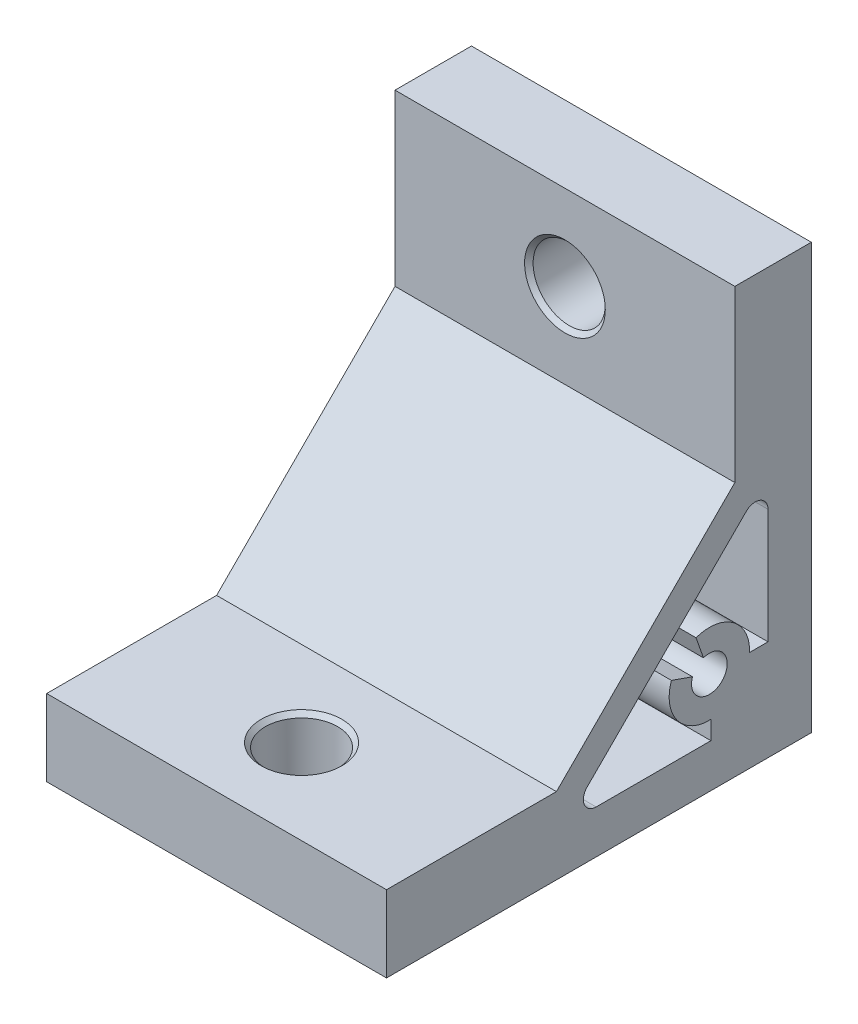
ISO-10303-21;
HEADER;
FILE_DESCRIPTION(('STEP AP214'),'2;1');
FILE_NAME('part.step','',(''),(''),'','','');
FILE_SCHEMA(('AUTOMOTIVE_DESIGN { 1 0 10303 214 1 1 1 1 }'));
ENDSEC;
DATA;
#1=APPLICATION_CONTEXT('core data for automotive mechanical design processes');
#2=APPLICATION_PROTOCOL_DEFINITION('international standard','automotive_design',2000,#1);
#3=PRODUCT_CONTEXT('',#1,'mechanical');
#4=PRODUCT('Part','Part','',(#3));
#5=PRODUCT_RELATED_PRODUCT_CATEGORY('part','',(#4));
#6=PRODUCT_DEFINITION_FORMATION('','',#4);
#7=PRODUCT_DEFINITION_CONTEXT('part definition',#1,'design');
#8=PRODUCT_DEFINITION('design','',#6,#7);
#9=PRODUCT_DEFINITION_SHAPE('','',#8);
#10=(LENGTH_UNIT() NAMED_UNIT(*) SI_UNIT(.MILLI.,.METRE.));
#11=(NAMED_UNIT(*) PLANE_ANGLE_UNIT() SI_UNIT($,.RADIAN.));
#12=(NAMED_UNIT(*) SI_UNIT($,.STERADIAN.) SOLID_ANGLE_UNIT());
#13=UNCERTAINTY_MEASURE_WITH_UNIT(LENGTH_MEASURE(1.E-05),#10,'distance_accuracy_value','');
#14=(GEOMETRIC_REPRESENTATION_CONTEXT(3) GLOBAL_UNCERTAINTY_ASSIGNED_CONTEXT((#13)) GLOBAL_UNIT_ASSIGNED_CONTEXT((#10,
#11,#12)) REPRESENTATION_CONTEXT('',''));
#15=CARTESIAN_POINT('',(0.,0.,0.));
#16=DIRECTION('',(0.,0.,1.));
#17=DIRECTION('',(1.,0.,0.));
#18=AXIS2_PLACEMENT_3D('',#15,#16,#17);
#19=CARTESIAN_POINT('',(20.,9.,25.));
#20=DIRECTION('',(0.,0.,-1.));
#21=DIRECTION('',(0.,1.,0.));
#22=AXIS2_PLACEMENT_3D('',#19,#20,#21);
#23=PLANE('',#22);
#24=DIRECTION('',(0.,-1.,0.));
#25=VECTOR('',#24,1.);
#26=CARTESIAN_POINT('',(-20.,9.,25.));
#27=LINE('',#26,#25);
#28=CARTESIAN_POINT('',(-20.,9.,25.));
#29=VERTEX_POINT('',#28);
#30=CARTESIAN_POINT('',(-20.,0.,25.));
#31=VERTEX_POINT('',#30);
#32=EDGE_CURVE('E247',#29,#31,#27,.T.);
#33=ORIENTED_EDGE('',*,*,#32,.T.);
#34=DIRECTION('',(-1.,0.,0.));
#35=VECTOR('',#34,1.);
#36=CARTESIAN_POINT('',(20.,0.,25.));
#37=LINE('',#36,#35);
#38=CARTESIAN_POINT('',(20.,0.,25.));
#39=VERTEX_POINT('',#38);
#40=EDGE_CURVE('E309',#39,#31,#37,.T.);
#41=ORIENTED_EDGE('',*,*,#40,.F.);
#42=DIRECTION('',(0.,-1.,0.));
#43=VECTOR('',#42,1.);
#44=CARTESIAN_POINT('',(20.,9.,25.));
#45=LINE('',#44,#43);
#46=CARTESIAN_POINT('',(20.,9.,25.));
#47=VERTEX_POINT('',#46);
#48=EDGE_CURVE('E262',#47,#39,#45,.T.);
#49=ORIENTED_EDGE('',*,*,#48,.F.);
#50=DIRECTION('',(-1.,0.,0.));
#51=VECTOR('',#50,1.);
#52=CARTESIAN_POINT('',(20.,9.,25.));
#53=LINE('',#52,#51);
#54=EDGE_CURVE('E278',#47,#29,#53,.T.);
#55=ORIENTED_EDGE('',*,*,#54,.T.);
#56=EDGE_LOOP('',(#33,#41,#49,#55));
#57=FACE_BOUND('',#56,.T.);
#58=ADVANCED_FACE('F16',(#57),#23,.F.);
#59=CARTESIAN_POINT('',(20.,0.,25.));
#60=DIRECTION('',(0.,1.,0.));
#61=DIRECTION('',(0.,0.,1.));
#62=AXIS2_PLACEMENT_3D('',#59,#60,#61);
#63=PLANE('',#62);
#64=CARTESIAN_POINT('',(0.,0.,15.));
#65=DIRECTION('',(0.,1.,0.));
#66=DIRECTION('',(0.,0.,1.));
#67=AXIS2_PLACEMENT_3D('',#64,#65,#66);
#68=CIRCLE('',#67,4.75);
#69=CARTESIAN_POINT('',(0.,0.,19.75));
#70=VERTEX_POINT('',#69);
#71=EDGE_CURVE('E327',#70,#70,#68,.T.);
#72=ORIENTED_EDGE('',*,*,#71,.T.);
#73=EDGE_LOOP('',(#72));
#74=FACE_BOUND('',#73,.T.);
#75=DIRECTION('',(0.,0.,-1.));
#76=VECTOR('',#75,1.);
#77=CARTESIAN_POINT('',(-20.,0.,25.));
#78=LINE('',#77,#76);
#79=CARTESIAN_POINT('',(-20.,0.,-25.));
#80=VERTEX_POINT('',#79);
#81=EDGE_CURVE('E281',#31,#80,#78,.T.);
#82=ORIENTED_EDGE('',*,*,#81,.T.);
#83=DIRECTION('',(-1.,0.,0.));
#84=VECTOR('',#83,1.);
#85=CARTESIAN_POINT('',(20.,0.,-25.));
#86=LINE('',#85,#84);
#87=CARTESIAN_POINT('',(20.,0.,-25.));
#88=VERTEX_POINT('',#87);
#89=EDGE_CURVE('E306',#88,#80,#86,.T.);
#90=ORIENTED_EDGE('',*,*,#89,.F.);
#91=DIRECTION('',(0.,0.,-1.));
#92=VECTOR('',#91,1.);
#93=CARTESIAN_POINT('',(20.,0.,25.));
#94=LINE('',#93,#92);
#95=EDGE_CURVE('E265',#39,#88,#94,.T.);
#96=ORIENTED_EDGE('',*,*,#95,.F.);
#97=ORIENTED_EDGE('',*,*,#40,.T.);
#98=EDGE_LOOP('',(#82,#90,#96,#97));
#99=FACE_BOUND('',#98,.T.);
#100=ADVANCED_FACE('F373',(#74,#99),#63,.F.);
#101=CARTESIAN_POINT('',(20.,0.,-25.));
#102=DIRECTION('',(0.,0.,1.));
#103=DIRECTION('',(0.,-1.,0.));
#104=AXIS2_PLACEMENT_3D('',#101,#102,#103);
#105=PLANE('',#104);
#106=CARTESIAN_POINT('',(0.,40.,-25.));
#107=DIRECTION('',(0.,0.,1.));
#108=DIRECTION('',(0.,-1.,0.));
#109=AXIS2_PLACEMENT_3D('',#106,#107,#108);
#110=CIRCLE('',#109,4.74999999999999);
#111=CARTESIAN_POINT('',(0.,35.25,-25.));
#112=VERTEX_POINT('',#111);
#113=EDGE_CURVE('E336',#112,#112,#110,.T.);
#114=ORIENTED_EDGE('',*,*,#113,.T.);
#115=EDGE_LOOP('',(#114));
#116=FACE_BOUND('',#115,.T.);
#117=DIRECTION('',(0.,1.,0.));
#118=VECTOR('',#117,1.);
#119=CARTESIAN_POINT('',(-20.,0.,-25.));
#120=LINE('',#119,#118);
#121=CARTESIAN_POINT('',(-20.,50.,-25.));
#122=VERTEX_POINT('',#121);
#123=EDGE_CURVE('E283',#80,#122,#120,.T.);
#124=ORIENTED_EDGE('',*,*,#123,.T.);
#125=DIRECTION('',(-1.,0.,0.));
#126=VECTOR('',#125,1.);
#127=CARTESIAN_POINT('',(20.,50.,-25.));
#128=LINE('',#127,#126);
#129=CARTESIAN_POINT('',(20.,50.,-25.));
#130=VERTEX_POINT('',#129);
#131=EDGE_CURVE('E303',#130,#122,#128,.T.);
#132=ORIENTED_EDGE('',*,*,#131,.F.);
#133=DIRECTION('',(0.,1.,0.));
#134=VECTOR('',#133,1.);
#135=CARTESIAN_POINT('',(20.,0.,-25.));
#136=LINE('',#135,#134);
#137=EDGE_CURVE('E268',#88,#130,#136,.T.);
#138=ORIENTED_EDGE('',*,*,#137,.F.);
#139=ORIENTED_EDGE('',*,*,#89,.T.);
#140=EDGE_LOOP('',(#124,#132,#138,#139));
#141=FACE_BOUND('',#140,.T.);
#142=ADVANCED_FACE('F379',(#116,#141),#105,.F.);
#143=CARTESIAN_POINT('',(20.,50.,-25.));
#144=DIRECTION('',(0.,-1.,0.));
#145=DIRECTION('',(0.,0.,-1.));
#146=AXIS2_PLACEMENT_3D('',#143,#144,#145);
#147=PLANE('',#146);
#148=DIRECTION('',(0.,0.,1.));
#149=VECTOR('',#148,1.);
#150=CARTESIAN_POINT('',(-20.,50.,-25.));
#151=LINE('',#150,#149);
#152=CARTESIAN_POINT('',(-20.,50.,-16.));
#153=VERTEX_POINT('',#152);
#154=EDGE_CURVE('E285',#122,#153,#151,.T.);
#155=ORIENTED_EDGE('',*,*,#154,.T.);
#156=DIRECTION('',(-1.,0.,0.));
#157=VECTOR('',#156,1.);
#158=CARTESIAN_POINT('',(20.,50.,-16.));
#159=LINE('',#158,#157);
#160=CARTESIAN_POINT('',(20.,50.,-16.));
#161=VERTEX_POINT('',#160);
#162=EDGE_CURVE('E300',#161,#153,#159,.T.);
#163=ORIENTED_EDGE('',*,*,#162,.F.);
#164=DIRECTION('',(0.,0.,1.));
#165=VECTOR('',#164,1.);
#166=CARTESIAN_POINT('',(20.,50.,-25.));
#167=LINE('',#166,#165);
#168=EDGE_CURVE('E270',#130,#161,#167,.T.);
#169=ORIENTED_EDGE('',*,*,#168,.F.);
#170=ORIENTED_EDGE('',*,*,#131,.T.);
#171=EDGE_LOOP('',(#155,#163,#169,#170));
#172=FACE_BOUND('',#171,.T.);
#173=ADVANCED_FACE('F401',(#172),#147,.F.);
#174=CARTESIAN_POINT('',(20.,50.,-16.));
#175=DIRECTION('',(0.,0.,-1.));
#176=DIRECTION('',(0.,1.,0.));
#177=AXIS2_PLACEMENT_3D('',#174,#175,#176);
#178=PLANE('',#177);
#179=CARTESIAN_POINT('',(0.,40.,-16.));
#180=DIRECTION('',(0.,0.,-1.));
#181=DIRECTION('',(0.,1.,0.));
#182=AXIS2_PLACEMENT_3D('',#179,#180,#181);
#183=CIRCLE('',#182,4.75000000000003);
#184=CARTESIAN_POINT('',(0.,44.75,-16.));
#185=VERTEX_POINT('',#184);
#186=EDGE_CURVE('E10',#185,#185,#183,.T.);
#187=ORIENTED_EDGE('',*,*,#186,.T.);
#188=EDGE_LOOP('',(#187));
#189=FACE_BOUND('',#188,.T.);
#190=DIRECTION('',(0.,-1.,0.));
#191=VECTOR('',#190,1.);
#192=CARTESIAN_POINT('',(-20.,50.,-16.));
#193=LINE('',#192,#191);
#194=CARTESIAN_POINT('',(-20.,30.,-16.));
#195=VERTEX_POINT('',#194);
#196=EDGE_CURVE('E287',#153,#195,#193,.T.);
#197=ORIENTED_EDGE('',*,*,#196,.T.);
#198=DIRECTION('',(-1.,0.,0.));
#199=VECTOR('',#198,1.);
#200=CARTESIAN_POINT('',(20.,30.,-16.));
#201=LINE('',#200,#199);
#202=CARTESIAN_POINT('',(20.,30.,-16.));
#203=VERTEX_POINT('',#202);
#204=EDGE_CURVE('E297',#203,#195,#201,.T.);
#205=ORIENTED_EDGE('',*,*,#204,.F.);
#206=DIRECTION('',(0.,-1.,0.));
#207=VECTOR('',#206,1.);
#208=CARTESIAN_POINT('',(20.,50.,-16.));
#209=LINE('',#208,#207);
#210=EDGE_CURVE('E272',#161,#203,#209,.T.);
#211=ORIENTED_EDGE('',*,*,#210,.F.);
#212=ORIENTED_EDGE('',*,*,#162,.T.);
#213=EDGE_LOOP('',(#197,#205,#211,#212));
#214=FACE_BOUND('',#213,.T.);
#215=ADVANCED_FACE('F416',(#189,#214),#178,.F.);
#216=CARTESIAN_POINT('',(20.,30.,-16.));
#217=DIRECTION('',(0.,-0.707106781186547,-0.707106781186548));
#218=DIRECTION('',(0.,0.707106781186548,-0.707106781186547));
#219=AXIS2_PLACEMENT_3D('',#216,#217,#218);
#220=PLANE('',#219);
#221=DIRECTION('',(0.,-0.707106781186548,0.707106781186547));
#222=VECTOR('',#221,1.);
#223=CARTESIAN_POINT('',(-20.,30.,-16.));
#224=LINE('',#223,#222);
#225=CARTESIAN_POINT('',(-20.,9.,5.));
#226=VERTEX_POINT('',#225);
#227=EDGE_CURVE('E289',#195,#226,#224,.T.);
#228=ORIENTED_EDGE('',*,*,#227,.T.);
#229=DIRECTION('',(-1.,0.,0.));
#230=VECTOR('',#229,1.);
#231=CARTESIAN_POINT('',(20.,9.,5.));
#232=LINE('',#231,#230);
#233=CARTESIAN_POINT('',(20.,9.,5.));
#234=VERTEX_POINT('',#233);
#235=EDGE_CURVE('E294',#234,#226,#232,.T.);
#236=ORIENTED_EDGE('',*,*,#235,.F.);
#237=DIRECTION('',(0.,-0.707106781186548,0.707106781186547));
#238=VECTOR('',#237,1.);
#239=CARTESIAN_POINT('',(20.,30.,-16.));
#240=LINE('',#239,#238);
#241=EDGE_CURVE('E274',#203,#234,#240,.T.);
#242=ORIENTED_EDGE('',*,*,#241,.F.);
#243=ORIENTED_EDGE('',*,*,#204,.T.);
#244=EDGE_LOOP('',(#228,#236,#242,#243));
#245=FACE_BOUND('',#244,.T.);
#246=ADVANCED_FACE('F420',(#245),#220,.F.);
#247=CARTESIAN_POINT('',(20.,9.,5.));
#248=DIRECTION('',(0.,-1.,0.));
#249=DIRECTION('',(0.,0.,-1.));
#250=AXIS2_PLACEMENT_3D('',#247,#248,#249);
#251=PLANE('',#250);
#252=CARTESIAN_POINT('',(0.,9.,15.));
#253=DIRECTION('',(0.,-1.,0.));
#254=DIRECTION('',(0.,0.,-1.));
#255=AXIS2_PLACEMENT_3D('',#252,#253,#254);
#256=CIRCLE('',#255,4.75000000000001);
#257=CARTESIAN_POINT('',(0.,9.,10.25));
#258=VERTEX_POINT('',#257);
#259=EDGE_CURVE('E24',#258,#258,#256,.T.);
#260=ORIENTED_EDGE('',*,*,#259,.T.);
#261=EDGE_LOOP('',(#260));
#262=FACE_BOUND('',#261,.T.);
#263=DIRECTION('',(0.,0.,1.));
#264=VECTOR('',#263,1.);
#265=CARTESIAN_POINT('',(-20.,9.,5.));
#266=LINE('',#265,#264);
#267=EDGE_CURVE('E266',#226,#29,#266,.T.);
#268=ORIENTED_EDGE('',*,*,#267,.T.);
#269=ORIENTED_EDGE('',*,*,#54,.F.);
#270=DIRECTION('',(0.,0.,1.));
#271=VECTOR('',#270,1.);
#272=CARTESIAN_POINT('',(20.,9.,5.));
#273=LINE('',#272,#271);
#274=EDGE_CURVE('E276',#234,#47,#273,.T.);
#275=ORIENTED_EDGE('',*,*,#274,.F.);
#276=ORIENTED_EDGE('',*,*,#235,.T.);
#277=EDGE_LOOP('',(#268,#269,#275,#276));
#278=FACE_BOUND('',#277,.T.);
#279=ADVANCED_FACE('F347',(#262,#278),#251,.F.);
#280=CARTESIAN_POINT('',(20.,0.,0.));
#281=DIRECTION('',(1.,0.,0.));
#282=DIRECTION('',(0.,0.,-1.));
#283=AXIS2_PLACEMENT_3D('',#280,#281,#282);
#284=PLANE('',#283);
#285=DIRECTION('',(0.,-0.707106781186548,0.707106781186547));
#286=VECTOR('',#285,1.);
#287=CARTESIAN_POINT('',(20.,28.9502525316942,-19.9));
#288=LINE('',#287,#286);
#289=CARTESIAN_POINT('',(20.,26.3895923599143,-17.3393398282202));
#290=VERTEX_POINT('',#289);
#291=CARTESIAN_POINT('',(20.,7.66066017177982,1.38959235991435));
#292=VERTEX_POINT('',#291);
#293=EDGE_CURVE('E213',#290,#292,#288,.T.);
#294=ORIENTED_EDGE('',*,*,#293,.F.);
#295=CARTESIAN_POINT('',(20.,25.3289321881345,-18.4));
#296=DIRECTION('',(1.,0.,0.));
#297=DIRECTION('',(0.,0.,-1.));
#298=AXIS2_PLACEMENT_3D('',#295,#296,#297);
#299=CIRCLE('',#298,1.5);
#300=CARTESIAN_POINT('',(20.,25.3289321881345,-19.9));
#301=VERTEX_POINT('',#300);
#302=EDGE_CURVE('E321',#290,#301,#299,.F.);
#303=ORIENTED_EDGE('',*,*,#302,.T.);
#304=DIRECTION('',(0.,1.,0.));
#305=VECTOR('',#304,1.);
#306=CARTESIAN_POINT('',(20.,11.8175144212722,-19.9));
#307=LINE('',#306,#305);
#308=CARTESIAN_POINT('',(20.,11.8175144212722,-19.9));
#309=VERTEX_POINT('',#308);
#310=EDGE_CURVE('E242',#309,#301,#307,.T.);
#311=ORIENTED_EDGE('',*,*,#310,.F.);
#312=DIRECTION('',(0.,0.,-1.));
#313=VECTOR('',#312,1.);
#314=CARTESIAN_POINT('',(20.,11.8175144212722,-19.9));
#315=LINE('',#314,#313);
#316=CARTESIAN_POINT('',(20.,11.8175144212722,-17.7212143947472));
#317=VERTEX_POINT('',#316);
#318=EDGE_CURVE('E239',#317,#309,#315,.T.);
#319=ORIENTED_EDGE('',*,*,#318,.F.);
#320=CARTESIAN_POINT('',(20.,11.9915806749646,-18.8106071973736));
#321=DIRECTION('',(1.,0.,0.));
#322=DIRECTION('',(0.,0.,-1.));
#323=AXIS2_PLACEMENT_3D('',#320,#321,#322);
#324=CIRCLE('',#323,1.10321155681434);
#325=CARTESIAN_POINT('',(20.,12.2187165848335,-17.7310308834723));
#326=VERTEX_POINT('',#325);
#327=EDGE_CURVE('E236',#326,#317,#324,.T.);
#328=ORIENTED_EDGE('',*,*,#327,.F.);
#329=CARTESIAN_POINT('',(20.,12.,-13.));
#330=DIRECTION('',(-1.,0.,0.));
#331=DIRECTION('',(0.,0.,-1.));
#332=AXIS2_PLACEMENT_3D('',#329,#330,#331);
#333=CIRCLE('',#332,4.73608384267528);
#334=CARTESIAN_POINT('',(20.,16.4685082983771,-11.4306295044877));
#335=VERTEX_POINT('',#334);
#336=EDGE_CURVE('E233',#335,#326,#333,.T.);
#337=ORIENTED_EDGE('',*,*,#336,.F.);
#338=DIRECTION('',(0.,0.943502785595325,0.331364593120421));
#339=VECTOR('',#338,1.);
#340=CARTESIAN_POINT('',(20.,16.4685082983771,-11.4306295044877));
#341=LINE('',#340,#339);
#342=CARTESIAN_POINT('',(20.,13.9813558497502,-12.3041343544471));
#343=VERTEX_POINT('',#342);
#344=EDGE_CURVE('E230',#343,#335,#341,.T.);
#345=ORIENTED_EDGE('',*,*,#344,.F.);
#346=CARTESIAN_POINT('',(20.,12.,-13.));
#347=DIRECTION('',(1.,0.,0.));
#348=DIRECTION('',(0.,0.,-1.));
#349=AXIS2_PLACEMENT_3D('',#346,#347,#348);
#350=CIRCLE('',#349,2.1);
#351=CARTESIAN_POINT('',(20.,12.6958656455529,-11.0186441502498));
#352=VERTEX_POINT('',#351);
#353=EDGE_CURVE('E227',#352,#343,#350,.T.);
#354=ORIENTED_EDGE('',*,*,#353,.F.);
#355=DIRECTION('',(0.,-0.331364593120421,-0.943502785595325));
#356=VECTOR('',#355,1.);
#357=CARTESIAN_POINT('',(20.,13.5693704955123,-8.53149170162285));
#358=LINE('',#357,#356);
#359=CARTESIAN_POINT('',(20.,13.5693704955123,-8.53149170162286));
#360=VERTEX_POINT('',#359);
#361=EDGE_CURVE('E224',#360,#352,#358,.T.);
#362=ORIENTED_EDGE('',*,*,#361,.F.);
#363=CARTESIAN_POINT('',(20.,12.,-13.));
#364=DIRECTION('',(-1.,0.,0.));
#365=DIRECTION('',(0.,0.,-1.));
#366=AXIS2_PLACEMENT_3D('',#363,#364,#365);
#367=CIRCLE('',#366,4.73608384267528);
#368=CARTESIAN_POINT('',(20.,7.26896911652771,-12.7812834151665));
#369=VERTEX_POINT('',#368);
#370=EDGE_CURVE('E221',#369,#360,#367,.T.);
#371=ORIENTED_EDGE('',*,*,#370,.F.);
#372=CARTESIAN_POINT('',(20.,6.1893928026264,-13.0084193250354));
#373=DIRECTION('',(1.,0.,0.));
#374=DIRECTION('',(0.,0.,1.));
#375=AXIS2_PLACEMENT_3D('',#372,#373,#374);
#376=CIRCLE('',#375,1.10321155681434);
#377=CARTESIAN_POINT('',(20.,7.27878560525279,-13.1824855787278));
#378=VERTEX_POINT('',#377);
#379=EDGE_CURVE('E219',#378,#369,#376,.T.);
#380=ORIENTED_EDGE('',*,*,#379,.F.);
#381=DIRECTION('',(0.,1.,0.));
#382=VECTOR('',#381,1.);
#383=CARTESIAN_POINT('',(20.,5.1,-13.1824855787278));
#384=LINE('',#383,#382);
#385=CARTESIAN_POINT('',(20.,5.1,-13.1824855787278));
#386=VERTEX_POINT('',#385);
#387=EDGE_CURVE('E169',#386,#378,#384,.T.);
#388=ORIENTED_EDGE('',*,*,#387,.F.);
#389=DIRECTION('',(0.,0.,-1.));
#390=VECTOR('',#389,1.);
#391=CARTESIAN_POINT('',(20.,5.1,3.95025253169417));
#392=LINE('',#391,#390);
#393=CARTESIAN_POINT('',(20.,5.1,0.328932188134529));
#394=VERTEX_POINT('',#393);
#395=EDGE_CURVE('E216',#394,#386,#392,.T.);
#396=ORIENTED_EDGE('',*,*,#395,.F.);
#397=CARTESIAN_POINT('',(20.,6.6,0.328932188134529));
#398=DIRECTION('',(1.,0.,0.));
#399=DIRECTION('',(0.,0.,-1.));
#400=AXIS2_PLACEMENT_3D('',#397,#398,#399);
#401=CIRCLE('',#400,1.5);
#402=EDGE_CURVE('E39',#394,#292,#401,.F.);
#403=ORIENTED_EDGE('',*,*,#402,.T.);
#404=EDGE_LOOP('',(#294,#303,#311,#319,#328,#337,#345,#354,#362,#371,#380,#388,#396,#403));
#405=FACE_BOUND('',#404,.T.);
#406=ORIENTED_EDGE('',*,*,#48,.T.);
#407=ORIENTED_EDGE('',*,*,#95,.T.);
#408=ORIENTED_EDGE('',*,*,#137,.T.);
#409=ORIENTED_EDGE('',*,*,#168,.T.);
#410=ORIENTED_EDGE('',*,*,#210,.T.);
#411=ORIENTED_EDGE('',*,*,#241,.T.);
#412=ORIENTED_EDGE('',*,*,#274,.T.);
#413=EDGE_LOOP('',(#406,#407,#408,#409,#410,#411,#412));
#414=FACE_BOUND('',#413,.T.);
#415=ADVANCED_FACE('F424',(#405,#414),#284,.T.);
#416=CARTESIAN_POINT('',(-20.,0.,0.));
#417=DIRECTION('',(1.,0.,0.));
#418=DIRECTION('',(0.,0.,-1.));
#419=AXIS2_PLACEMENT_3D('',#416,#417,#418);
#420=PLANE('',#419);
#421=DIRECTION('',(0.,1.,0.));
#422=VECTOR('',#421,1.);
#423=CARTESIAN_POINT('',(-20.,11.8175144212722,-19.9));
#424=LINE('',#423,#422);
#425=CARTESIAN_POINT('',(-20.,11.8175144212722,-19.9));
#426=VERTEX_POINT('',#425);
#427=CARTESIAN_POINT('',(-20.,25.3289321881345,-19.9));
#428=VERTEX_POINT('',#427);
#429=EDGE_CURVE('E211',#426,#428,#424,.T.);
#430=ORIENTED_EDGE('',*,*,#429,.T.);
#431=CARTESIAN_POINT('',(-20.,25.3289321881345,-18.4));
#432=DIRECTION('',(1.,0.,0.));
#433=DIRECTION('',(0.,0.,-1.));
#434=AXIS2_PLACEMENT_3D('',#431,#432,#433);
#435=CIRCLE('',#434,1.5);
#436=CARTESIAN_POINT('',(-20.,26.3895923599143,-17.3393398282202));
#437=VERTEX_POINT('',#436);
#438=EDGE_CURVE('E323',#428,#437,#435,.T.);
#439=ORIENTED_EDGE('',*,*,#438,.T.);
#440=DIRECTION('',(0.,-0.707106781186548,0.707106781186547));
#441=VECTOR('',#440,1.);
#442=CARTESIAN_POINT('',(-20.,28.9502525316942,-19.9));
#443=LINE('',#442,#441);
#444=CARTESIAN_POINT('',(-20.,7.66066017177982,1.38959235991435));
#445=VERTEX_POINT('',#444);
#446=EDGE_CURVE('E188',#437,#445,#443,.T.);
#447=ORIENTED_EDGE('',*,*,#446,.T.);
#448=CARTESIAN_POINT('',(-20.,6.6,0.328932188134529));
#449=DIRECTION('',(1.,0.,0.));
#450=DIRECTION('',(0.,0.,-1.));
#451=AXIS2_PLACEMENT_3D('',#448,#449,#450);
#452=CIRCLE('',#451,1.5);
#453=CARTESIAN_POINT('',(-20.,5.1,0.328932188134529));
#454=VERTEX_POINT('',#453);
#455=EDGE_CURVE('E31',#445,#454,#452,.T.);
#456=ORIENTED_EDGE('',*,*,#455,.T.);
#457=DIRECTION('',(0.,0.,-1.));
#458=VECTOR('',#457,1.);
#459=CARTESIAN_POINT('',(-20.,5.1,3.95025253169417));
#460=LINE('',#459,#458);
#461=CARTESIAN_POINT('',(-20.,5.1,-13.1824855787278));
#462=VERTEX_POINT('',#461);
#463=EDGE_CURVE('E186',#454,#462,#460,.T.);
#464=ORIENTED_EDGE('',*,*,#463,.T.);
#465=DIRECTION('',(0.,1.,0.));
#466=VECTOR('',#465,1.);
#467=CARTESIAN_POINT('',(-20.,5.1,-13.1824855787278));
#468=LINE('',#467,#466);
#469=CARTESIAN_POINT('',(-20.,7.27878560525279,-13.1824855787278));
#470=VERTEX_POINT('',#469);
#471=EDGE_CURVE('E166',#462,#470,#468,.T.);
#472=ORIENTED_EDGE('',*,*,#471,.T.);
#473=CARTESIAN_POINT('',(-20.,6.1893928026264,-13.0084193250354));
#474=DIRECTION('',(1.,0.,0.));
#475=DIRECTION('',(0.,0.,1.));
#476=AXIS2_PLACEMENT_3D('',#473,#474,#475);
#477=CIRCLE('',#476,1.10321155681434);
#478=CARTESIAN_POINT('',(-20.,7.26896911652771,-12.7812834151665));
#479=VERTEX_POINT('',#478);
#480=EDGE_CURVE('E177',#470,#479,#477,.T.);
#481=ORIENTED_EDGE('',*,*,#480,.T.);
#482=CARTESIAN_POINT('',(-20.,12.,-13.));
#483=DIRECTION('',(-1.,0.,0.));
#484=DIRECTION('',(0.,0.,-1.));
#485=AXIS2_PLACEMENT_3D('',#482,#483,#484);
#486=CIRCLE('',#485,4.73608384267528);
#487=CARTESIAN_POINT('',(-20.,13.5693704955123,-8.53149170162286));
#488=VERTEX_POINT('',#487);
#489=EDGE_CURVE('E181',#479,#488,#486,.T.);
#490=ORIENTED_EDGE('',*,*,#489,.T.);
#491=DIRECTION('',(0.,-0.331364593120421,-0.943502785595325));
#492=VECTOR('',#491,1.);
#493=CARTESIAN_POINT('',(-20.,13.5693704955123,-8.53149170162285));
#494=LINE('',#493,#492);
#495=CARTESIAN_POINT('',(-20.,12.6958656455529,-11.0186441502498));
#496=VERTEX_POINT('',#495);
#497=EDGE_CURVE('E193',#488,#496,#494,.T.);
#498=ORIENTED_EDGE('',*,*,#497,.T.);
#499=CARTESIAN_POINT('',(-20.,12.,-13.));
#500=DIRECTION('',(1.,0.,0.));
#501=DIRECTION('',(0.,0.,-1.));
#502=AXIS2_PLACEMENT_3D('',#499,#500,#501);
#503=CIRCLE('',#502,2.1);
#504=CARTESIAN_POINT('',(-20.,13.9813558497502,-12.3041343544471));
#505=VERTEX_POINT('',#504);
#506=EDGE_CURVE('E196',#496,#505,#503,.T.);
#507=ORIENTED_EDGE('',*,*,#506,.T.);
#508=DIRECTION('',(0.,0.943502785595325,0.331364593120421));
#509=VECTOR('',#508,1.);
#510=CARTESIAN_POINT('',(-20.,16.4685082983771,-11.4306295044877));
#511=LINE('',#510,#509);
#512=CARTESIAN_POINT('',(-20.,16.4685082983771,-11.4306295044877));
#513=VERTEX_POINT('',#512);
#514=EDGE_CURVE('E199',#505,#513,#511,.T.);
#515=ORIENTED_EDGE('',*,*,#514,.T.);
#516=CARTESIAN_POINT('',(-20.,12.,-13.));
#517=DIRECTION('',(-1.,0.,0.));
#518=DIRECTION('',(0.,0.,-1.));
#519=AXIS2_PLACEMENT_3D('',#516,#517,#518);
#520=CIRCLE('',#519,4.73608384267528);
#521=CARTESIAN_POINT('',(-20.,12.2187165848335,-17.7310308834723));
#522=VERTEX_POINT('',#521);
#523=EDGE_CURVE('E202',#513,#522,#520,.T.);
#524=ORIENTED_EDGE('',*,*,#523,.T.);
#525=CARTESIAN_POINT('',(-20.,11.9915806749646,-18.8106071973736));
#526=DIRECTION('',(1.,0.,0.));
#527=DIRECTION('',(0.,0.,-1.));
#528=AXIS2_PLACEMENT_3D('',#525,#526,#527);
#529=CIRCLE('',#528,1.10321155681434);
#530=CARTESIAN_POINT('',(-20.,11.8175144212722,-17.7212143947472));
#531=VERTEX_POINT('',#530);
#532=EDGE_CURVE('E205',#522,#531,#529,.T.);
#533=ORIENTED_EDGE('',*,*,#532,.T.);
#534=DIRECTION('',(0.,0.,-1.));
#535=VECTOR('',#534,1.);
#536=CARTESIAN_POINT('',(-20.,11.8175144212722,-19.9));
#537=LINE('',#536,#535);
#538=EDGE_CURVE('E208',#531,#426,#537,.T.);
#539=ORIENTED_EDGE('',*,*,#538,.T.);
#540=EDGE_LOOP('',(#430,#439,#447,#456,#464,#472,#481,#490,#498,#507,#515,#524,#533,#539));
#541=FACE_BOUND('',#540,.T.);
#542=ORIENTED_EDGE('',*,*,#32,.F.);
#543=ORIENTED_EDGE('',*,*,#267,.F.);
#544=ORIENTED_EDGE('',*,*,#227,.F.);
#545=ORIENTED_EDGE('',*,*,#196,.F.);
#546=ORIENTED_EDGE('',*,*,#154,.F.);
#547=ORIENTED_EDGE('',*,*,#123,.F.);
#548=ORIENTED_EDGE('',*,*,#81,.F.);
#549=EDGE_LOOP('',(#542,#543,#544,#545,#546,#547,#548));
#550=FACE_BOUND('',#549,.T.);
#551=ADVANCED_FACE('F184',(#541,#550),#420,.F.);
#552=CARTESIAN_POINT('',(-20.,28.9502525316942,-19.9));
#553=DIRECTION('',(0.,0.707106781186547,0.707106781186548));
#554=DIRECTION('',(0.,-0.707106781186548,0.707106781186547));
#555=AXIS2_PLACEMENT_3D('',#552,#553,#554);
#556=PLANE('',#555);
#557=ORIENTED_EDGE('',*,*,#446,.F.);
#558=DIRECTION('',(1.,0.,0.));
#559=VECTOR('',#558,1.);
#560=CARTESIAN_POINT('',(20.,26.3895923599143,-17.3393398282202));
#561=LINE('',#560,#559);
#562=EDGE_CURVE('E314',#437,#290,#561,.T.);
#563=ORIENTED_EDGE('',*,*,#562,.T.);
#564=ORIENTED_EDGE('',*,*,#293,.T.);
#565=DIRECTION('',(1.,0.,0.));
#566=VECTOR('',#565,1.);
#567=CARTESIAN_POINT('',(-20.,7.66066017177982,1.38959235991435));
#568=LINE('',#567,#566);
#569=EDGE_CURVE('E312',#292,#445,#568,.F.);
#570=ORIENTED_EDGE('',*,*,#569,.T.);
#571=EDGE_LOOP('',(#557,#563,#564,#570));
#572=FACE_BOUND('',#571,.T.);
#573=ADVANCED_FACE('F484',(#572),#556,.F.);
#574=CARTESIAN_POINT('',(-20.,11.8175144212722,-19.9));
#575=DIRECTION('',(0.,0.,-1.));
#576=DIRECTION('',(0.,1.,0.));
#577=AXIS2_PLACEMENT_3D('',#574,#575,#576);
#578=PLANE('',#577);
#579=ORIENTED_EDGE('',*,*,#310,.T.);
#580=DIRECTION('',(1.,0.,0.));
#581=VECTOR('',#580,1.);
#582=CARTESIAN_POINT('',(-20.,25.3289321881345,-19.9));
#583=LINE('',#582,#581);
#584=EDGE_CURVE('E317',#301,#428,#583,.F.);
#585=ORIENTED_EDGE('',*,*,#584,.T.);
#586=ORIENTED_EDGE('',*,*,#429,.F.);
#587=DIRECTION('',(1.,0.,0.));
#588=VECTOR('',#587,1.);
#589=CARTESIAN_POINT('',(-20.,11.8175144212722,-19.9));
#590=LINE('',#589,#588);
#591=EDGE_CURVE('E245',#426,#309,#590,.T.);
#592=ORIENTED_EDGE('',*,*,#591,.T.);
#593=EDGE_LOOP('',(#579,#585,#586,#592));
#594=FACE_BOUND('',#593,.T.);
#595=ADVANCED_FACE('F492',(#594),#578,.F.);
#596=CARTESIAN_POINT('',(-20.,11.8175144212722,-19.9));
#597=DIRECTION('',(0.,-1.,0.));
#598=DIRECTION('',(0.,0.,-1.));
#599=AXIS2_PLACEMENT_3D('',#596,#597,#598);
#600=PLANE('',#599);
#601=ORIENTED_EDGE('',*,*,#318,.T.);
#602=ORIENTED_EDGE('',*,*,#591,.F.);
#603=ORIENTED_EDGE('',*,*,#538,.F.);
#604=DIRECTION('',(1.,0.,0.));
#605=VECTOR('',#604,1.);
#606=CARTESIAN_POINT('',(-20.,11.8175144212722,-17.7212143947472));
#607=LINE('',#606,#605);
#608=EDGE_CURVE('E248',#531,#317,#607,.T.);
#609=ORIENTED_EDGE('',*,*,#608,.T.);
#610=EDGE_LOOP('',(#601,#602,#603,#609));
#611=FACE_BOUND('',#610,.T.);
#612=ADVANCED_FACE('F502',(#611),#600,.F.);
#613=CARTESIAN_POINT('',(-20.,11.9915806749646,-18.8106071973736));
#614=DIRECTION('',(1.,0.,0.));
#615=DIRECTION('',(0.,0.,-1.));
#616=AXIS2_PLACEMENT_3D('',#613,#614,#615);
#617=CYLINDRICAL_SURFACE('',#616,1.10321155681434);
#618=ORIENTED_EDGE('',*,*,#327,.T.);
#619=ORIENTED_EDGE('',*,*,#608,.F.);
#620=ORIENTED_EDGE('',*,*,#532,.F.);
#621=DIRECTION('',(1.,0.,0.));
#622=VECTOR('',#621,1.);
#623=CARTESIAN_POINT('',(-20.,12.2187165848335,-17.7310308834723));
#624=LINE('',#623,#622);
#625=EDGE_CURVE('E250',#522,#326,#624,.T.);
#626=ORIENTED_EDGE('',*,*,#625,.T.);
#627=EDGE_LOOP('',(#618,#619,#620,#626));
#628=FACE_BOUND('',#627,.T.);
#629=ADVANCED_FACE('F512',(#628),#617,.F.);
#630=CARTESIAN_POINT('',(-20.,12.,-13.));
#631=DIRECTION('',(1.,0.,0.));
#632=DIRECTION('',(0.,0.,-1.));
#633=AXIS2_PLACEMENT_3D('',#630,#631,#632);
#634=CYLINDRICAL_SURFACE('',#633,4.73608384267528);
#635=ORIENTED_EDGE('',*,*,#336,.T.);
#636=ORIENTED_EDGE('',*,*,#625,.F.);
#637=ORIENTED_EDGE('',*,*,#523,.F.);
#638=DIRECTION('',(1.,0.,0.));
#639=VECTOR('',#638,1.);
#640=CARTESIAN_POINT('',(-20.,16.4685082983771,-11.4306295044877));
#641=LINE('',#640,#639);
#642=EDGE_CURVE('E252',#513,#335,#641,.T.);
#643=ORIENTED_EDGE('',*,*,#642,.T.);
#644=EDGE_LOOP('',(#635,#636,#637,#643));
#645=FACE_BOUND('',#644,.T.);
#646=ADVANCED_FACE('F522',(#645),#634,.T.);
#647=CARTESIAN_POINT('',(-20.,16.4685082983771,-11.4306295044877));
#648=DIRECTION('',(0.,0.331364593120421,-0.943502785595325));
#649=DIRECTION('',(0.,0.943502785595325,0.331364593120421));
#650=AXIS2_PLACEMENT_3D('',#647,#648,#649);
#651=PLANE('',#650);
#652=ORIENTED_EDGE('',*,*,#344,.T.);
#653=ORIENTED_EDGE('',*,*,#642,.F.);
#654=ORIENTED_EDGE('',*,*,#514,.F.);
#655=DIRECTION('',(1.,0.,0.));
#656=VECTOR('',#655,1.);
#657=CARTESIAN_POINT('',(-20.,13.9813558497502,-12.3041343544471));
#658=LINE('',#657,#656);
#659=EDGE_CURVE('E254',#505,#343,#658,.T.);
#660=ORIENTED_EDGE('',*,*,#659,.T.);
#661=EDGE_LOOP('',(#652,#653,#654,#660));
#662=FACE_BOUND('',#661,.T.);
#663=ADVANCED_FACE('F532',(#662),#651,.F.);
#664=CARTESIAN_POINT('',(-20.,12.,-13.));
#665=DIRECTION('',(1.,0.,0.));
#666=DIRECTION('',(0.,0.,-1.));
#667=AXIS2_PLACEMENT_3D('',#664,#665,#666);
#668=CYLINDRICAL_SURFACE('',#667,2.1);
#669=ORIENTED_EDGE('',*,*,#353,.T.);
#670=ORIENTED_EDGE('',*,*,#659,.F.);
#671=ORIENTED_EDGE('',*,*,#506,.F.);
#672=DIRECTION('',(1.,0.,0.));
#673=VECTOR('',#672,1.);
#674=CARTESIAN_POINT('',(-20.,12.6958656455529,-11.0186441502498));
#675=LINE('',#674,#673);
#676=EDGE_CURVE('E256',#496,#352,#675,.T.);
#677=ORIENTED_EDGE('',*,*,#676,.T.);
#678=EDGE_LOOP('',(#669,#670,#671,#677));
#679=FACE_BOUND('',#678,.T.);
#680=ADVANCED_FACE('F542',(#679),#668,.F.);
#681=CARTESIAN_POINT('',(-20.,13.5693704955123,-8.53149170162285));
#682=DIRECTION('',(0.,-0.943502785595325,0.331364593120421));
#683=DIRECTION('',(0.,-0.331364593120421,-0.943502785595325));
#684=AXIS2_PLACEMENT_3D('',#681,#682,#683);
#685=PLANE('',#684);
#686=ORIENTED_EDGE('',*,*,#361,.T.);
#687=ORIENTED_EDGE('',*,*,#676,.F.);
#688=ORIENTED_EDGE('',*,*,#497,.F.);
#689=DIRECTION('',(1.,0.,0.));
#690=VECTOR('',#689,1.);
#691=CARTESIAN_POINT('',(-20.,13.5693704955123,-8.53149170162286));
#692=LINE('',#691,#690);
#693=EDGE_CURVE('E258',#488,#360,#692,.T.);
#694=ORIENTED_EDGE('',*,*,#693,.T.);
#695=EDGE_LOOP('',(#686,#687,#688,#694));
#696=FACE_BOUND('',#695,.T.);
#697=ADVANCED_FACE('F553',(#696),#685,.F.);
#698=CARTESIAN_POINT('',(-20.,12.,-13.));
#699=DIRECTION('',(1.,0.,0.));
#700=DIRECTION('',(0.,0.,-1.));
#701=AXIS2_PLACEMENT_3D('',#698,#699,#700);
#702=CYLINDRICAL_SURFACE('',#701,4.73608384267528);
#703=ORIENTED_EDGE('',*,*,#370,.T.);
#704=ORIENTED_EDGE('',*,*,#693,.F.);
#705=ORIENTED_EDGE('',*,*,#489,.F.);
#706=DIRECTION('',(1.,0.,0.));
#707=VECTOR('',#706,1.);
#708=CARTESIAN_POINT('',(-20.,7.26896911652771,-12.7812834151665));
#709=LINE('',#708,#707);
#710=EDGE_CURVE('E173',#479,#369,#709,.T.);
#711=ORIENTED_EDGE('',*,*,#710,.T.);
#712=EDGE_LOOP('',(#703,#704,#705,#711));
#713=FACE_BOUND('',#712,.T.);
#714=ADVANCED_FACE('F565',(#713),#702,.T.);
#715=CARTESIAN_POINT('',(-20.,6.1893928026264,-13.0084193250354));
#716=DIRECTION('',(1.,0.,0.));
#717=DIRECTION('',(0.,0.,-1.));
#718=AXIS2_PLACEMENT_3D('',#715,#716,#717);
#719=CYLINDRICAL_SURFACE('',#718,1.10321155681434);
#720=ORIENTED_EDGE('',*,*,#379,.T.);
#721=ORIENTED_EDGE('',*,*,#710,.F.);
#722=ORIENTED_EDGE('',*,*,#480,.F.);
#723=DIRECTION('',(1.,0.,0.));
#724=VECTOR('',#723,1.);
#725=CARTESIAN_POINT('',(-20.,7.27878560525279,-13.1824855787278));
#726=LINE('',#725,#724);
#727=EDGE_CURVE('E161',#470,#378,#726,.T.);
#728=ORIENTED_EDGE('',*,*,#727,.T.);
#729=EDGE_LOOP('',(#720,#721,#722,#728));
#730=FACE_BOUND('',#729,.T.);
#731=ADVANCED_FACE('F178',(#730),#719,.F.);
#732=CARTESIAN_POINT('',(-20.,5.1,-13.1824855787278));
#733=DIRECTION('',(0.,0.,-1.));
#734=DIRECTION('',(-1.,0.,0.));
#735=AXIS2_PLACEMENT_3D('',#732,#733,#734);
#736=PLANE('',#735);
#737=ORIENTED_EDGE('',*,*,#387,.T.);
#738=ORIENTED_EDGE('',*,*,#727,.F.);
#739=ORIENTED_EDGE('',*,*,#471,.F.);
#740=DIRECTION('',(1.,0.,0.));
#741=VECTOR('',#740,1.);
#742=CARTESIAN_POINT('',(-20.,5.1,-13.1824855787278));
#743=LINE('',#742,#741);
#744=EDGE_CURVE('E174',#462,#386,#743,.T.);
#745=ORIENTED_EDGE('',*,*,#744,.T.);
#746=EDGE_LOOP('',(#737,#738,#739,#745));
#747=FACE_BOUND('',#746,.T.);
#748=ADVANCED_FACE('F163',(#747),#736,.F.);
#749=CARTESIAN_POINT('',(-20.,5.1,3.95025253169417));
#750=DIRECTION('',(0.,-1.,0.));
#751=DIRECTION('',(0.,0.,-1.));
#752=AXIS2_PLACEMENT_3D('',#749,#750,#751);
#753=PLANE('',#752);
#754=ORIENTED_EDGE('',*,*,#463,.F.);
#755=DIRECTION('',(1.,0.,0.));
#756=VECTOR('',#755,1.);
#757=CARTESIAN_POINT('',(20.,5.1,0.328932188134529));
#758=LINE('',#757,#756);
#759=EDGE_CURVE('E319',#454,#394,#758,.T.);
#760=ORIENTED_EDGE('',*,*,#759,.T.);
#761=ORIENTED_EDGE('',*,*,#395,.T.);
#762=ORIENTED_EDGE('',*,*,#744,.F.);
#763=EDGE_LOOP('',(#754,#760,#761,#762));
#764=FACE_BOUND('',#763,.T.);
#765=ADVANCED_FACE('F387',(#764),#753,.F.);
#766=CARTESIAN_POINT('',(-20.,25.3289321881345,-18.4));
#767=DIRECTION('',(-1.,0.,0.));
#768=DIRECTION('',(0.,0.,1.));
#769=AXIS2_PLACEMENT_3D('',#766,#767,#768);
#770=CYLINDRICAL_SURFACE('',#769,1.5);
#771=ORIENTED_EDGE('',*,*,#438,.F.);
#772=ORIENTED_EDGE('',*,*,#584,.F.);
#773=ORIENTED_EDGE('',*,*,#302,.F.);
#774=ORIENTED_EDGE('',*,*,#562,.F.);
#775=EDGE_LOOP('',(#771,#772,#773,#774));
#776=FACE_BOUND('',#775,.T.);
#777=ADVANCED_FACE('F384',(#776),#770,.F.);
#778=CARTESIAN_POINT('',(-20.,6.6,0.328932188134529));
#779=DIRECTION('',(-1.,0.,0.));
#780=DIRECTION('',(0.,0.,1.));
#781=AXIS2_PLACEMENT_3D('',#778,#779,#780);
#782=CYLINDRICAL_SURFACE('',#781,1.5);
#783=ORIENTED_EDGE('',*,*,#455,.F.);
#784=ORIENTED_EDGE('',*,*,#569,.F.);
#785=ORIENTED_EDGE('',*,*,#402,.F.);
#786=ORIENTED_EDGE('',*,*,#759,.F.);
#787=EDGE_LOOP('',(#783,#784,#785,#786));
#788=FACE_BOUND('',#787,.T.);
#789=ADVANCED_FACE('F369',(#788),#782,.F.);
#790=CARTESIAN_POINT('',(0.,40.,-25.));
#791=DIRECTION('',(0.,0.,1.));
#792=DIRECTION('',(1.,0.,0.));
#793=AXIS2_PLACEMENT_3D('',#790,#791,#792);
#794=CYLINDRICAL_SURFACE('',#793,4.25);
#795=CARTESIAN_POINT('',(0.,40.,-24.5));
#796=DIRECTION('',(0.,0.,1.));
#797=DIRECTION('',(1.,0.,0.));
#798=AXIS2_PLACEMENT_3D('',#795,#796,#797);
#799=CIRCLE('',#798,4.25);
#800=CARTESIAN_POINT('',(4.25000000000001,40.,-24.5));
#801=VERTEX_POINT('',#800);
#802=EDGE_CURVE('E342',#801,#801,#799,.F.);
#803=ORIENTED_EDGE('',*,*,#802,.T.);
#804=EDGE_LOOP('',(#803));
#805=FACE_BOUND('',#804,.T.);
#806=CARTESIAN_POINT('',(0.,40.,-16.5));
#807=DIRECTION('',(0.,0.,-1.));
#808=DIRECTION('',(-1.,0.,0.));
#809=AXIS2_PLACEMENT_3D('',#806,#807,#808);
#810=CIRCLE('',#809,4.25);
#811=CARTESIAN_POINT('',(-4.25,40.,-16.5));
#812=VERTEX_POINT('',#811);
#813=EDGE_CURVE('E339',#812,#812,#810,.F.);
#814=ORIENTED_EDGE('',*,*,#813,.T.);
#815=EDGE_LOOP('',(#814));
#816=FACE_BOUND('',#815,.T.);
#817=ADVANCED_FACE('F359',(#805,#816),#794,.F.);
#818=CARTESIAN_POINT('',(0.,0.,15.));
#819=DIRECTION('',(0.,1.,0.));
#820=DIRECTION('',(0.,0.,1.));
#821=AXIS2_PLACEMENT_3D('',#818,#819,#820);
#822=CYLINDRICAL_SURFACE('',#821,4.25);
#823=CARTESIAN_POINT('',(0.,0.500000000000009,15.));
#824=DIRECTION('',(0.,1.,0.));
#825=DIRECTION('',(0.,0.,1.));
#826=AXIS2_PLACEMENT_3D('',#823,#824,#825);
#827=CIRCLE('',#826,4.25);
#828=CARTESIAN_POINT('',(0.,0.500000000000009,19.25));
#829=VERTEX_POINT('',#828);
#830=EDGE_CURVE('E333',#829,#829,#827,.F.);
#831=ORIENTED_EDGE('',*,*,#830,.T.);
#832=EDGE_LOOP('',(#831));
#833=FACE_BOUND('',#832,.T.);
#834=CARTESIAN_POINT('',(0.,8.49999999999999,15.));
#835=DIRECTION('',(0.,-1.,0.));
#836=DIRECTION('',(0.,0.,-1.));
#837=AXIS2_PLACEMENT_3D('',#834,#835,#836);
#838=CIRCLE('',#837,4.25);
#839=CARTESIAN_POINT('',(0.,8.49999999999999,10.75));
#840=VERTEX_POINT('',#839);
#841=EDGE_CURVE('E330',#840,#840,#838,.F.);
#842=ORIENTED_EDGE('',*,*,#841,.T.);
#843=EDGE_LOOP('',(#842));
#844=FACE_BOUND('',#843,.T.);
#845=ADVANCED_FACE('F356',(#833,#844),#822,.F.);
#846=CARTESIAN_POINT('',(0.,0.,15.));
#847=DIRECTION('',(0.,-1.,0.));
#848=DIRECTION('',(0.,0.,-1.));
#849=AXIS2_PLACEMENT_3D('',#846,#847,#848);
#850=CONICAL_SURFACE('',#849,4.75,0.785398163397436);
#851=ORIENTED_EDGE('',*,*,#830,.F.);
#852=EDGE_LOOP('',(#851));
#853=FACE_BOUND('',#852,.T.);
#854=ORIENTED_EDGE('',*,*,#71,.F.);
#855=EDGE_LOOP('',(#854));
#856=FACE_BOUND('',#855,.T.);
#857=ADVANCED_FACE('F358',(#853,#856),#850,.F.);
#858=CARTESIAN_POINT('',(0.,40.,-25.));
#859=DIRECTION('',(0.,0.,-1.));
#860=DIRECTION('',(-1.,0.,0.));
#861=AXIS2_PLACEMENT_3D('',#858,#859,#860);
#862=CONICAL_SURFACE('',#861,4.74999999999999,0.785398163397445);
#863=ORIENTED_EDGE('',*,*,#802,.F.);
#864=EDGE_LOOP('',(#863));
#865=FACE_BOUND('',#864,.T.);
#866=ORIENTED_EDGE('',*,*,#113,.F.);
#867=EDGE_LOOP('',(#866));
#868=FACE_BOUND('',#867,.T.);
#869=ADVANCED_FACE('F353',(#865,#868),#862,.F.);
#870=CARTESIAN_POINT('',(0.,8.49999999999999,15.));
#871=DIRECTION('',(0.,1.,0.));
#872=DIRECTION('',(0.,0.,1.));
#873=AXIS2_PLACEMENT_3D('',#870,#871,#872);
#874=CONICAL_SURFACE('',#873,4.25,0.785398163397449);
#875=ORIENTED_EDGE('',*,*,#259,.F.);
#876=EDGE_LOOP('',(#875));
#877=FACE_BOUND('',#876,.T.);
#878=ORIENTED_EDGE('',*,*,#841,.F.);
#879=EDGE_LOOP('',(#878));
#880=FACE_BOUND('',#879,.T.);
#881=ADVANCED_FACE('F350',(#877,#880),#874,.F.);
#882=CARTESIAN_POINT('',(0.,40.,-16.5));
#883=DIRECTION('',(0.,0.,1.));
#884=DIRECTION('',(1.,0.,0.));
#885=AXIS2_PLACEMENT_3D('',#882,#883,#884);
#886=CONICAL_SURFACE('',#885,4.25,0.785398163397448);
#887=ORIENTED_EDGE('',*,*,#186,.F.);
#888=EDGE_LOOP('',(#887));
#889=FACE_BOUND('',#888,.T.);
#890=ORIENTED_EDGE('',*,*,#813,.F.);
#891=EDGE_LOOP('',(#890));
#892=FACE_BOUND('',#891,.T.);
#893=ADVANCED_FACE('F18',(#889,#892),#886,.F.);
#894=CLOSED_SHELL('',(#58,#100,#142,#173,#215,#246,#279,#415,#551,#573,#595,#612,#629,#646,#663,
#680,#697,#714,#731,#748,#765,#777,#789,#817,#845,#857,#869,#881,#893));
#895=MANIFOLD_SOLID_BREP('B1',#894);
#896=ADVANCED_BREP_SHAPE_REPRESENTATION('',(#18,#895),#14);
#897=SHAPE_DEFINITION_REPRESENTATION(#9,#896);
ENDSEC;
END-ISO-10303-21;
